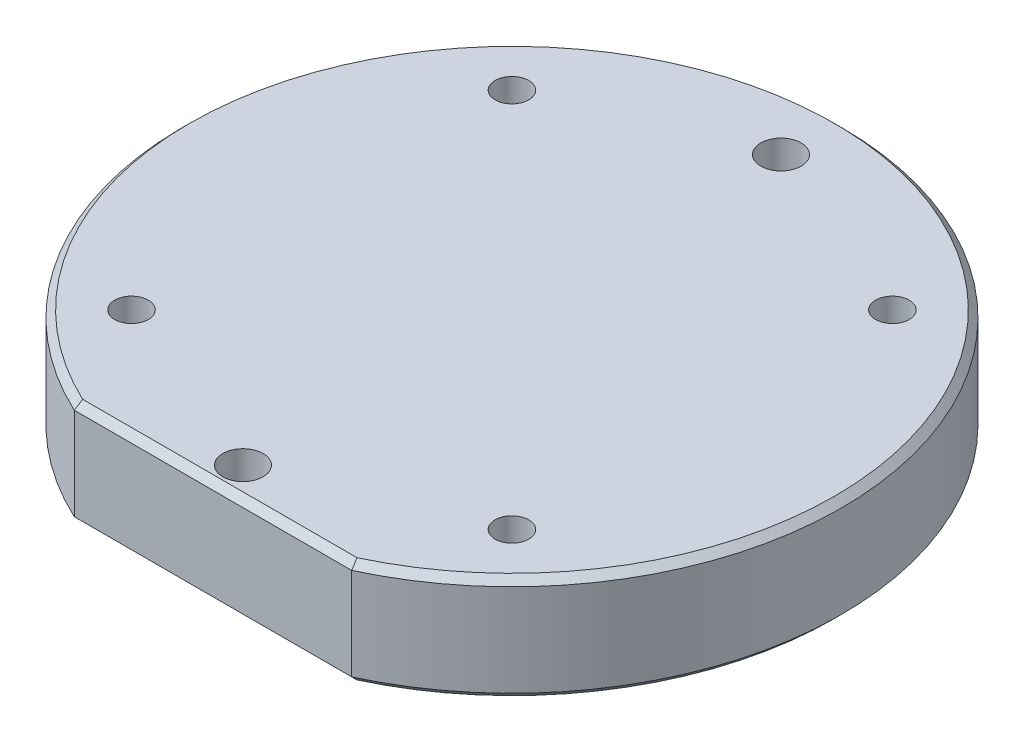
ISO-10303-21;
HEADER;
FILE_DESCRIPTION(('STEP AP214'),'2;1');
FILE_NAME('part.step','',(''),(''),'','','');
FILE_SCHEMA(('AUTOMOTIVE_DESIGN { 1 0 10303 214 1 1 1 1 }'));
ENDSEC;
DATA;
#1=APPLICATION_CONTEXT('core data for automotive mechanical design processes');
#2=APPLICATION_PROTOCOL_DEFINITION('international standard','automotive_design',2000,#1);
#3=PRODUCT_CONTEXT('',#1,'mechanical');
#4=PRODUCT('Part','Part','',(#3));
#5=PRODUCT_RELATED_PRODUCT_CATEGORY('part','',(#4));
#6=PRODUCT_DEFINITION_FORMATION('','',#4);
#7=PRODUCT_DEFINITION_CONTEXT('part definition',#1,'design');
#8=PRODUCT_DEFINITION('design','',#6,#7);
#9=PRODUCT_DEFINITION_SHAPE('','',#8);
#10=(LENGTH_UNIT() NAMED_UNIT(*) SI_UNIT(.MILLI.,.METRE.));
#11=(NAMED_UNIT(*) PLANE_ANGLE_UNIT() SI_UNIT($,.RADIAN.));
#12=(NAMED_UNIT(*) SI_UNIT($,.STERADIAN.) SOLID_ANGLE_UNIT());
#13=UNCERTAINTY_MEASURE_WITH_UNIT(LENGTH_MEASURE(1.E-05),#10,'distance_accuracy_value','');
#14=(GEOMETRIC_REPRESENTATION_CONTEXT(3) GLOBAL_UNCERTAINTY_ASSIGNED_CONTEXT((#13)) GLOBAL_UNIT_ASSIGNED_CONTEXT((#10,
#11,#12)) REPRESENTATION_CONTEXT('',''));
#15=CARTESIAN_POINT('',(0.,0.,0.));
#16=DIRECTION('',(0.,0.,1.));
#17=DIRECTION('',(1.,0.,0.));
#18=AXIS2_PLACEMENT_3D('',#15,#16,#17);
#19=CARTESIAN_POINT('',(0.,7.874,0.));
#20=DIRECTION('',(0.,-1.,0.));
#21=DIRECTION('',(0.,0.,-1.));
#22=AXIS2_PLACEMENT_3D('',#19,#20,#21);
#23=PLANE('',#22);
#24=DIRECTION('',(1.,0.,0.));
#25=VECTOR('',#24,1.);
#26=CARTESIAN_POINT('',(0.,7.874,21.717));
#27=LINE('',#26,#25);
#28=CARTESIAN_POINT('',(-10.197449436011,7.874,21.717));
#29=VERTEX_POINT('',#28);
#30=CARTESIAN_POINT('',(10.197449436011,7.874,21.717));
#31=VERTEX_POINT('',#30);
#32=EDGE_CURVE('E24',#29,#31,#27,.T.);
#33=ORIENTED_EDGE('',*,*,#32,.T.);
#34=CARTESIAN_POINT('',(0.,7.874,0.));
#35=DIRECTION('',(0.,-1.,0.));
#36=DIRECTION('',(0.,0.,-1.));
#37=AXIS2_PLACEMENT_3D('',#34,#35,#36);
#38=CIRCLE('',#37,23.992);
#39=EDGE_CURVE('E11',#31,#29,#38,.F.);
#40=ORIENTED_EDGE('',*,*,#39,.T.);
#41=EDGE_LOOP('',(#33,#40));
#42=FACE_BOUND('',#41,.T.);
#43=CARTESIAN_POINT('',(0.,7.874,20.));
#44=DIRECTION('',(0.,1.,0.));
#45=DIRECTION('',(0.,0.,1.));
#46=AXIS2_PLACEMENT_3D('',#43,#44,#45);
#47=CIRCLE('',#46,1.5);
#48=CARTESIAN_POINT('',(0.,7.874,21.5));
#49=VERTEX_POINT('',#48);
#50=EDGE_CURVE('E71',#49,#49,#47,.T.);
#51=ORIENTED_EDGE('',*,*,#50,.F.);
#52=EDGE_LOOP('',(#51));
#53=FACE_BOUND('',#52,.T.);
#54=CARTESIAN_POINT('',(0.,7.874,-20.));
#55=DIRECTION('',(0.,1.,0.));
#56=DIRECTION('',(0.,0.,1.));
#57=AXIS2_PLACEMENT_3D('',#54,#55,#56);
#58=CIRCLE('',#57,1.5);
#59=CARTESIAN_POINT('',(0.,7.874,-18.5));
#60=VERTEX_POINT('',#59);
#61=EDGE_CURVE('E84',#60,#60,#58,.T.);
#62=ORIENTED_EDGE('',*,*,#61,.F.);
#63=EDGE_LOOP('',(#62));
#64=FACE_BOUND('',#63,.T.);
#65=CARTESIAN_POINT('',(14.1421356237311,7.874,-14.1421356237308));
#66=DIRECTION('',(0.,1.,0.));
#67=DIRECTION('',(0.,0.,1.));
#68=AXIS2_PLACEMENT_3D('',#65,#66,#67);
#69=CIRCLE('',#68,1.24999999999999);
#70=CARTESIAN_POINT('',(14.1421356237311,7.874,-12.8921356237308));
#71=VERTEX_POINT('',#70);
#72=EDGE_CURVE('E90',#71,#71,#69,.T.);
#73=ORIENTED_EDGE('',*,*,#72,.F.);
#74=EDGE_LOOP('',(#73));
#75=FACE_BOUND('',#74,.T.);
#76=CARTESIAN_POINT('',(-14.1421356237308,7.874,-14.1421356237311));
#77=DIRECTION('',(0.,1.,0.));
#78=DIRECTION('',(0.,0.,1.));
#79=AXIS2_PLACEMENT_3D('',#76,#77,#78);
#80=CIRCLE('',#79,1.24999999999999);
#81=CARTESIAN_POINT('',(-14.1421356237308,7.874,-12.8921356237311));
#82=VERTEX_POINT('',#81);
#83=EDGE_CURVE('E96',#82,#82,#80,.T.);
#84=ORIENTED_EDGE('',*,*,#83,.F.);
#85=EDGE_LOOP('',(#84));
#86=FACE_BOUND('',#85,.T.);
#87=CARTESIAN_POINT('',(-14.142135623731,7.874,14.1421356237309));
#88=DIRECTION('',(0.,1.,0.));
#89=DIRECTION('',(0.,0.,1.));
#90=AXIS2_PLACEMENT_3D('',#87,#88,#89);
#91=CIRCLE('',#90,1.24999999999999);
#92=CARTESIAN_POINT('',(-14.142135623731,7.874,15.3921356237309));
#93=VERTEX_POINT('',#92);
#94=EDGE_CURVE('E102',#93,#93,#91,.T.);
#95=ORIENTED_EDGE('',*,*,#94,.F.);
#96=EDGE_LOOP('',(#95));
#97=FACE_BOUND('',#96,.T.);
#98=CARTESIAN_POINT('',(14.1421356237309,7.874,14.142135623731));
#99=DIRECTION('',(0.,1.,0.));
#100=DIRECTION('',(0.,0.,1.));
#101=AXIS2_PLACEMENT_3D('',#98,#99,#100);
#102=CIRCLE('',#101,1.24999999999999);
#103=CARTESIAN_POINT('',(14.1421356237309,7.874,15.392135623731));
#104=VERTEX_POINT('',#103);
#105=EDGE_CURVE('E108',#104,#104,#102,.T.);
#106=ORIENTED_EDGE('',*,*,#105,.F.);
#107=EDGE_LOOP('',(#106));
#108=FACE_BOUND('',#107,.T.);
#109=ADVANCED_FACE('F17',(#42,#53,#64,#75,#86,#97,#108),#23,.F.);
#110=CARTESIAN_POINT('',(0.,0.,0.));
#111=DIRECTION('',(0.,1.,0.));
#112=DIRECTION('',(0.,0.,1.));
#113=AXIS2_PLACEMENT_3D('',#110,#111,#112);
#114=CYLINDRICAL_SURFACE('',#113,24.5);
#115=DIRECTION('',(0.,1.,0.));
#116=VECTOR('',#115,1.);
#117=CARTESIAN_POINT('',(10.3101588251588,0.,22.225));
#118=LINE('',#117,#116);
#119=CARTESIAN_POINT('',(10.3101588251588,0.508000000000002,22.225));
#120=VERTEX_POINT('',#119);
#121=CARTESIAN_POINT('',(10.3101588251588,7.366,22.225));
#122=VERTEX_POINT('',#121);
#123=EDGE_CURVE('E78',#120,#122,#118,.T.);
#124=ORIENTED_EDGE('',*,*,#123,.F.);
#125=CARTESIAN_POINT('',(0.,0.508000000000002,0.));
#126=DIRECTION('',(0.,1.,0.));
#127=DIRECTION('',(0.,0.,1.));
#128=AXIS2_PLACEMENT_3D('',#125,#126,#127);
#129=CIRCLE('',#128,24.5);
#130=CARTESIAN_POINT('',(-10.3101588251588,0.508000000000002,22.225));
#131=VERTEX_POINT('',#130);
#132=EDGE_CURVE('E124',#120,#131,#129,.T.);
#133=ORIENTED_EDGE('',*,*,#132,.T.);
#134=DIRECTION('',(0.,1.,0.));
#135=VECTOR('',#134,1.);
#136=CARTESIAN_POINT('',(-10.3101588251588,0.,22.225));
#137=LINE('',#136,#135);
#138=CARTESIAN_POINT('',(-10.3101588251588,7.366,22.225));
#139=VERTEX_POINT('',#138);
#140=EDGE_CURVE('E72',#131,#139,#137,.T.);
#141=ORIENTED_EDGE('',*,*,#140,.T.);
#142=CARTESIAN_POINT('',(0.,7.366,0.));
#143=DIRECTION('',(0.,-1.,0.));
#144=DIRECTION('',(0.,0.,-1.));
#145=AXIS2_PLACEMENT_3D('',#142,#143,#144);
#146=CIRCLE('',#145,24.5);
#147=EDGE_CURVE('E121',#139,#122,#146,.T.);
#148=ORIENTED_EDGE('',*,*,#147,.T.);
#149=EDGE_LOOP('',(#124,#133,#141,#148));
#150=FACE_BOUND('',#149,.T.);
#151=ADVANCED_FACE('F129',(#150),#114,.T.);
#152=CARTESIAN_POINT('',(0.,0.,0.));
#153=DIRECTION('',(0.,1.,0.));
#154=DIRECTION('',(0.,0.,1.));
#155=AXIS2_PLACEMENT_3D('',#152,#153,#154);
#156=PLANE('',#155);
#157=CARTESIAN_POINT('',(0.,0.,0.));
#158=DIRECTION('',(0.,1.,0.));
#159=DIRECTION('',(0.,0.,1.));
#160=AXIS2_PLACEMENT_3D('',#157,#158,#159);
#161=CIRCLE('',#160,23.992);
#162=CARTESIAN_POINT('',(-10.197449436011,0.,21.717));
#163=VERTEX_POINT('',#162);
#164=CARTESIAN_POINT('',(10.197449436011,0.,21.717));
#165=VERTEX_POINT('',#164);
#166=EDGE_CURVE('E111',#163,#165,#161,.F.);
#167=ORIENTED_EDGE('',*,*,#166,.T.);
#168=DIRECTION('',(-1.,0.,0.));
#169=VECTOR('',#168,1.);
#170=CARTESIAN_POINT('',(0.,0.,21.717));
#171=LINE('',#170,#169);
#172=EDGE_CURVE('E113',#165,#163,#171,.T.);
#173=ORIENTED_EDGE('',*,*,#172,.T.);
#174=EDGE_LOOP('',(#167,#173));
#175=FACE_BOUND('',#174,.T.);
#176=CARTESIAN_POINT('',(14.1421356237311,0.,-14.1421356237308));
#177=DIRECTION('',(0.,1.,0.));
#178=DIRECTION('',(0.,0.,1.));
#179=AXIS2_PLACEMENT_3D('',#176,#177,#178);
#180=CIRCLE('',#179,1.25);
#181=CARTESIAN_POINT('',(14.1421356237311,0.,-12.8921356237308));
#182=VERTEX_POINT('',#181);
#183=EDGE_CURVE('E87',#182,#182,#180,.T.);
#184=ORIENTED_EDGE('',*,*,#183,.T.);
#185=EDGE_LOOP('',(#184));
#186=FACE_BOUND('',#185,.T.);
#187=CARTESIAN_POINT('',(-14.1421356237308,0.,-14.1421356237311));
#188=DIRECTION('',(0.,1.,0.));
#189=DIRECTION('',(0.,0.,1.));
#190=AXIS2_PLACEMENT_3D('',#187,#188,#189);
#191=CIRCLE('',#190,1.25);
#192=CARTESIAN_POINT('',(-14.1421356237308,0.,-12.8921356237311));
#193=VERTEX_POINT('',#192);
#194=EDGE_CURVE('E93',#193,#193,#191,.T.);
#195=ORIENTED_EDGE('',*,*,#194,.T.);
#196=EDGE_LOOP('',(#195));
#197=FACE_BOUND('',#196,.T.);
#198=CARTESIAN_POINT('',(-14.142135623731,0.,14.1421356237309));
#199=DIRECTION('',(0.,1.,0.));
#200=DIRECTION('',(0.,0.,1.));
#201=AXIS2_PLACEMENT_3D('',#198,#199,#200);
#202=CIRCLE('',#201,1.25);
#203=CARTESIAN_POINT('',(-14.142135623731,0.,15.3921356237309));
#204=VERTEX_POINT('',#203);
#205=EDGE_CURVE('E99',#204,#204,#202,.T.);
#206=ORIENTED_EDGE('',*,*,#205,.T.);
#207=EDGE_LOOP('',(#206));
#208=FACE_BOUND('',#207,.T.);
#209=CARTESIAN_POINT('',(14.1421356237309,0.,14.142135623731));
#210=DIRECTION('',(0.,1.,0.));
#211=DIRECTION('',(0.,0.,1.));
#212=AXIS2_PLACEMENT_3D('',#209,#210,#211);
#213=CIRCLE('',#212,1.25);
#214=CARTESIAN_POINT('',(14.1421356237309,0.,15.392135623731));
#215=VERTEX_POINT('',#214);
#216=EDGE_CURVE('E105',#215,#215,#213,.T.);
#217=ORIENTED_EDGE('',*,*,#216,.T.);
#218=EDGE_LOOP('',(#217));
#219=FACE_BOUND('',#218,.T.);
#220=ADVANCED_FACE('F195',(#175,#186,#197,#208,#219),#156,.F.);
#221=CARTESIAN_POINT('',(14.1421356237309,7.874,14.142135623731));
#222=DIRECTION('',(0.,1.,0.));
#223=DIRECTION('',(0.,0.,1.));
#224=AXIS2_PLACEMENT_3D('',#221,#222,#223);
#225=CYLINDRICAL_SURFACE('',#224,1.24999999999999);
#226=ORIENTED_EDGE('',*,*,#216,.F.);
#227=EDGE_LOOP('',(#226));
#228=FACE_BOUND('',#227,.T.);
#229=ORIENTED_EDGE('',*,*,#105,.T.);
#230=EDGE_LOOP('',(#229));
#231=FACE_BOUND('',#230,.T.);
#232=ADVANCED_FACE('F191',(#228,#231),#225,.F.);
#233=CARTESIAN_POINT('',(-14.142135623731,7.874,14.1421356237309));
#234=DIRECTION('',(0.,1.,0.));
#235=DIRECTION('',(0.,0.,1.));
#236=AXIS2_PLACEMENT_3D('',#233,#234,#235);
#237=CYLINDRICAL_SURFACE('',#236,1.24999999999999);
#238=ORIENTED_EDGE('',*,*,#205,.F.);
#239=EDGE_LOOP('',(#238));
#240=FACE_BOUND('',#239,.T.);
#241=ORIENTED_EDGE('',*,*,#94,.T.);
#242=EDGE_LOOP('',(#241));
#243=FACE_BOUND('',#242,.T.);
#244=ADVANCED_FACE('F187',(#240,#243),#237,.F.);
#245=CARTESIAN_POINT('',(-14.1421356237308,7.874,-14.1421356237311));
#246=DIRECTION('',(0.,1.,0.));
#247=DIRECTION('',(0.,0.,1.));
#248=AXIS2_PLACEMENT_3D('',#245,#246,#247);
#249=CYLINDRICAL_SURFACE('',#248,1.24999999999999);
#250=ORIENTED_EDGE('',*,*,#194,.F.);
#251=EDGE_LOOP('',(#250));
#252=FACE_BOUND('',#251,.T.);
#253=ORIENTED_EDGE('',*,*,#83,.T.);
#254=EDGE_LOOP('',(#253));
#255=FACE_BOUND('',#254,.T.);
#256=ADVANCED_FACE('F183',(#252,#255),#249,.F.);
#257=CARTESIAN_POINT('',(14.1421356237311,7.874,-14.1421356237308));
#258=DIRECTION('',(0.,1.,0.));
#259=DIRECTION('',(0.,0.,1.));
#260=AXIS2_PLACEMENT_3D('',#257,#258,#259);
#261=CYLINDRICAL_SURFACE('',#260,1.24999999999999);
#262=ORIENTED_EDGE('',*,*,#183,.F.);
#263=EDGE_LOOP('',(#262));
#264=FACE_BOUND('',#263,.T.);
#265=ORIENTED_EDGE('',*,*,#72,.T.);
#266=EDGE_LOOP('',(#265));
#267=FACE_BOUND('',#266,.T.);
#268=ADVANCED_FACE('F179',(#264,#267),#261,.F.);
#269=CARTESIAN_POINT('',(0.,7.874,-20.));
#270=DIRECTION('',(0.,1.,0.));
#271=DIRECTION('',(0.,0.,1.));
#272=AXIS2_PLACEMENT_3D('',#269,#270,#271);
#273=CYLINDRICAL_SURFACE('',#272,1.5);
#274=CARTESIAN_POINT('',(0.,3.374009,-20.));
#275=DIRECTION('',(0.,1.,0.));
#276=DIRECTION('',(0.,0.,1.));
#277=AXIS2_PLACEMENT_3D('',#274,#275,#276);
#278=CIRCLE('',#277,1.5);
#279=CARTESIAN_POINT('',(0.,3.374009,-18.5));
#280=VERTEX_POINT('',#279);
#281=EDGE_CURVE('E75',#280,#280,#278,.T.);
#282=ORIENTED_EDGE('',*,*,#281,.F.);
#283=EDGE_LOOP('',(#282));
#284=FACE_BOUND('',#283,.T.);
#285=ORIENTED_EDGE('',*,*,#61,.T.);
#286=EDGE_LOOP('',(#285));
#287=FACE_BOUND('',#286,.T.);
#288=ADVANCED_FACE('F175',(#284,#287),#273,.F.);
#289=CARTESIAN_POINT('',(0.,3.374009,-20.));
#290=DIRECTION('',(0.,1.,0.));
#291=DIRECTION('',(0.,0.,1.));
#292=AXIS2_PLACEMENT_3D('',#289,#290,#291);
#293=CONICAL_SURFACE('',#292,1.5,1.02974425867665);
#294=CARTESIAN_POINT('',(0.,2.47271807145866,-20.));
#295=VERTEX_POINT('',#294);
#296=VERTEX_LOOP('',#295);
#297=FACE_BOUND('',#296,.T.);
#298=ORIENTED_EDGE('',*,*,#281,.T.);
#299=EDGE_LOOP('',(#298));
#300=FACE_BOUND('',#299,.T.);
#301=ADVANCED_FACE('F172',(#297,#300),#293,.F.);
#302=CARTESIAN_POINT('',(0.,7.874,20.));
#303=DIRECTION('',(0.,1.,0.));
#304=DIRECTION('',(0.,0.,1.));
#305=AXIS2_PLACEMENT_3D('',#302,#303,#304);
#306=CYLINDRICAL_SURFACE('',#305,1.5);
#307=CARTESIAN_POINT('',(0.,3.374009,20.));
#308=DIRECTION('',(0.,1.,0.));
#309=DIRECTION('',(0.,0.,1.));
#310=AXIS2_PLACEMENT_3D('',#307,#308,#309);
#311=CIRCLE('',#310,1.5);
#312=CARTESIAN_POINT('',(0.,3.374009,21.5));
#313=VERTEX_POINT('',#312);
#314=EDGE_CURVE('E69',#313,#313,#311,.T.);
#315=ORIENTED_EDGE('',*,*,#314,.F.);
#316=EDGE_LOOP('',(#315));
#317=FACE_BOUND('',#316,.T.);
#318=ORIENTED_EDGE('',*,*,#50,.T.);
#319=EDGE_LOOP('',(#318));
#320=FACE_BOUND('',#319,.T.);
#321=ADVANCED_FACE('F65',(#317,#320),#306,.F.);
#322=CARTESIAN_POINT('',(0.,3.374009,20.));
#323=DIRECTION('',(0.,1.,0.));
#324=DIRECTION('',(0.,0.,1.));
#325=AXIS2_PLACEMENT_3D('',#322,#323,#324);
#326=CONICAL_SURFACE('',#325,1.5,1.02974425867665);
#327=CARTESIAN_POINT('',(0.,2.47271807145866,20.));
#328=VERTEX_POINT('',#327);
#329=VERTEX_LOOP('',#328);
#330=FACE_BOUND('',#329,.T.);
#331=ORIENTED_EDGE('',*,*,#314,.T.);
#332=EDGE_LOOP('',(#331));
#333=FACE_BOUND('',#332,.T.);
#334=ADVANCED_FACE('F61',(#330,#333),#326,.F.);
#335=CARTESIAN_POINT('',(10.3101588251588,0.,22.225));
#336=DIRECTION('',(0.,0.,-1.));
#337=DIRECTION('',(-1.,0.,0.));
#338=AXIS2_PLACEMENT_3D('',#335,#336,#337);
#339=PLANE('',#338);
#340=ORIENTED_EDGE('',*,*,#140,.F.);
#341=DIRECTION('',(1.,0.,0.));
#342=VECTOR('',#341,1.);
#343=CARTESIAN_POINT('',(10.3101588251588,0.508000000000002,22.225));
#344=LINE('',#343,#342);
#345=EDGE_CURVE('E118',#131,#120,#344,.T.);
#346=ORIENTED_EDGE('',*,*,#345,.T.);
#347=ORIENTED_EDGE('',*,*,#123,.T.);
#348=DIRECTION('',(-1.,0.,0.));
#349=VECTOR('',#348,1.);
#350=CARTESIAN_POINT('',(10.3101588251588,7.366,22.225));
#351=LINE('',#350,#349);
#352=EDGE_CURVE('E116',#122,#139,#351,.T.);
#353=ORIENTED_EDGE('',*,*,#352,.T.);
#354=EDGE_LOOP('',(#340,#346,#347,#353));
#355=FACE_BOUND('',#354,.T.);
#356=ADVANCED_FACE('F64',(#355),#339,.F.);
#357=CARTESIAN_POINT('',(0.,0.508000000000002,0.));
#358=DIRECTION('',(0.,1.,0.));
#359=DIRECTION('',(0.,0.,1.));
#360=AXIS2_PLACEMENT_3D('',#357,#358,#359);
#361=CONICAL_SURFACE('',#360,24.5,0.785398163397448);
#362=CARTESIAN_POINT('',(-10.197449436011,0.,21.717));
#363=CARTESIAN_POINT('',(-10.2163350955516,0.0846554889238912,21.8016554889239));
#364=CARTESIAN_POINT('',(-10.2351703744348,0.169316566797695,21.8863165667977));
#365=CARTESIAN_POINT('',(-10.2727401708171,0.33864990013107,22.0556499001311));
#366=CARTESIAN_POINT('',(-10.2914746883164,0.4233221555906,22.1403221555906));
#367=CARTESIAN_POINT('',(-10.3101588251588,0.508000000000001,22.225));
#368=B_SPLINE_CURVE_WITH_KNOTS('',3,(#362,#363,#364,#365,#366,#367),.UNSPECIFIED.,.F.,.F.,(4,2,
4),(0.,0.363604009187298,0.727208017025861),.UNSPECIFIED.);
#369=EDGE_CURVE('E140',#131,#163,#368,.F.);
#370=ORIENTED_EDGE('',*,*,#369,.F.);
#371=ORIENTED_EDGE('',*,*,#132,.F.);
#372=CARTESIAN_POINT('',(10.3101588251588,0.508000000000002,22.225));
#373=CARTESIAN_POINT('',(10.2914746883164,0.4233221555906,22.1403221555906));
#374=CARTESIAN_POINT('',(10.2727401708171,0.33864990013107,22.0556499001311));
#375=CARTESIAN_POINT('',(10.2351703744348,0.169316566797695,21.8863165667977));
#376=CARTESIAN_POINT('',(10.2163350955516,0.0846554889238923,21.8016554889239));
#377=CARTESIAN_POINT('',(10.197449436011,0.,21.717));
#378=B_SPLINE_CURVE_WITH_KNOTS('',3,(#372,#373,#374,#375,#376,#377),.UNSPECIFIED.,.F.,.F.,(4,2,
4),(0.,0.363604007838563,0.727208017025859),.UNSPECIFIED.);
#379=EDGE_CURVE('E142',#165,#120,#378,.F.);
#380=ORIENTED_EDGE('',*,*,#379,.F.);
#381=ORIENTED_EDGE('',*,*,#166,.F.);
#382=EDGE_LOOP('',(#370,#371,#380,#381));
#383=FACE_BOUND('',#382,.T.);
#384=ADVANCED_FACE('F143',(#383),#361,.T.);
#385=CARTESIAN_POINT('',(0.,0.,21.717));
#386=DIRECTION('',(0.,0.707106781186547,-0.707106781186547));
#387=DIRECTION('',(0.,0.707106781186548,0.707106781186548));
#388=AXIS2_PLACEMENT_3D('',#385,#386,#387);
#389=PLANE('',#388);
#390=ORIENTED_EDGE('',*,*,#379,.T.);
#391=ORIENTED_EDGE('',*,*,#345,.F.);
#392=ORIENTED_EDGE('',*,*,#369,.T.);
#393=ORIENTED_EDGE('',*,*,#172,.F.);
#394=EDGE_LOOP('',(#390,#391,#392,#393));
#395=FACE_BOUND('',#394,.T.);
#396=ADVANCED_FACE('F138',(#395),#389,.F.);
#397=CARTESIAN_POINT('',(10.3101588251588,7.366,22.225));
#398=DIRECTION('',(0.,-0.70710678118655,-0.707106781186545));
#399=DIRECTION('',(0.,0.707106781186545,-0.70710678118655));
#400=AXIS2_PLACEMENT_3D('',#397,#398,#399);
#401=PLANE('',#400);
#402=CARTESIAN_POINT('',(-10.197449436011,7.874,21.717));
#403=CARTESIAN_POINT('',(-10.2163350955516,7.78934451107611,21.8016554889239));
#404=CARTESIAN_POINT('',(-10.2351703744348,7.7046834332023,21.8863165667977));
#405=CARTESIAN_POINT('',(-10.2727401708171,7.53535009986893,22.0556499001311));
#406=CARTESIAN_POINT('',(-10.2914746883164,7.4506778444094,22.1403221555906));
#407=CARTESIAN_POINT('',(-10.3101588251588,7.366,22.225));
#408=B_SPLINE_CURVE_WITH_KNOTS('',3,(#402,#403,#404,#405,#406,#407),.UNSPECIFIED.,.F.,.F.,(4,2,
4),(0.,0.363604009187298,0.727208017025863),.UNSPECIFIED.);
#409=EDGE_CURVE('E36',#139,#29,#408,.F.);
#410=ORIENTED_EDGE('',*,*,#409,.F.);
#411=ORIENTED_EDGE('',*,*,#352,.F.);
#412=CARTESIAN_POINT('',(10.3101588251588,7.366,22.225));
#413=CARTESIAN_POINT('',(10.2914746883164,7.4506778444094,22.1403221555906));
#414=CARTESIAN_POINT('',(10.2727401708171,7.53535009986893,22.0556499001311));
#415=CARTESIAN_POINT('',(10.2351703744348,7.7046834332023,21.8863165667977));
#416=CARTESIAN_POINT('',(10.2163350955516,7.78934451107611,21.8016554889239));
#417=CARTESIAN_POINT('',(10.197449436011,7.874,21.717));
#418=B_SPLINE_CURVE_WITH_KNOTS('',3,(#412,#413,#414,#415,#416,#417),.UNSPECIFIED.,.F.,.F.,(4,2,
4),(0.,0.363604007838565,0.727208017025861),.UNSPECIFIED.);
#419=EDGE_CURVE('E144',#31,#122,#418,.F.);
#420=ORIENTED_EDGE('',*,*,#419,.F.);
#421=ORIENTED_EDGE('',*,*,#32,.F.);
#422=EDGE_LOOP('',(#410,#411,#420,#421));
#423=FACE_BOUND('',#422,.T.);
#424=ADVANCED_FACE('F166',(#423),#401,.F.);
#425=CARTESIAN_POINT('',(0.,7.874,0.));
#426=DIRECTION('',(0.,-1.,0.));
#427=DIRECTION('',(0.,0.,-1.));
#428=AXIS2_PLACEMENT_3D('',#425,#426,#427);
#429=CONICAL_SURFACE('',#428,23.992,0.785398163397452);
#430=ORIENTED_EDGE('',*,*,#419,.T.);
#431=ORIENTED_EDGE('',*,*,#147,.F.);
#432=ORIENTED_EDGE('',*,*,#409,.T.);
#433=ORIENTED_EDGE('',*,*,#39,.F.);
#434=EDGE_LOOP('',(#430,#431,#432,#433));
#435=FACE_BOUND('',#434,.T.);
#436=ADVANCED_FACE('F316',(#435),#429,.T.);
#437=CLOSED_SHELL('',(#109,#151,#220,#232,#244,#256,#268,#288,#301,#321,#334,#356,#384,#396,
#424,#436));
#438=MANIFOLD_SOLID_BREP('B1',#437);
#439=ADVANCED_BREP_SHAPE_REPRESENTATION('',(#18,#438),#14);
#440=SHAPE_DEFINITION_REPRESENTATION(#9,#439);
ENDSEC;
END-ISO-10303-21;
